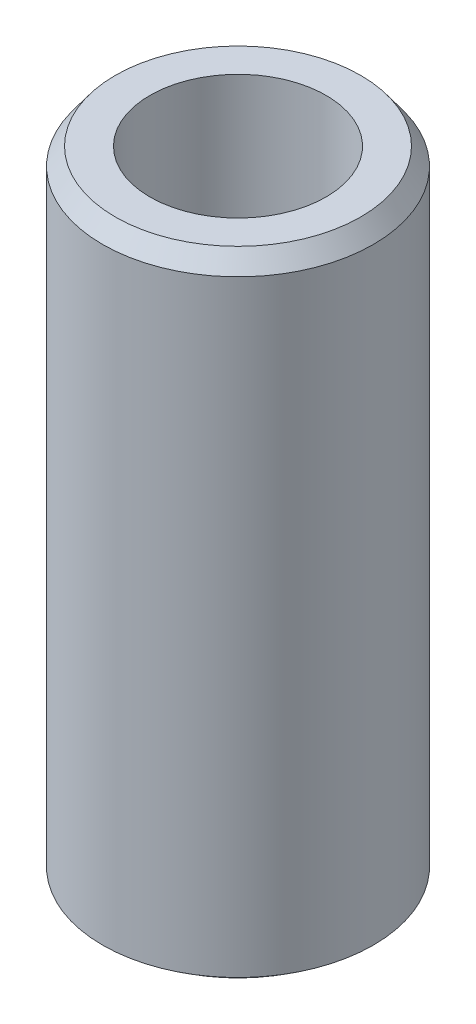
ISO-10303-21;
HEADER;
FILE_DESCRIPTION(('STEP AP214'),'2;1');
FILE_NAME('part.step','',(''),(''),'','','');
FILE_SCHEMA(('AUTOMOTIVE_DESIGN { 1 0 10303 214 1 1 1 1 }'));
ENDSEC;
DATA;
#1=APPLICATION_CONTEXT('core data for automotive mechanical design processes');
#2=APPLICATION_PROTOCOL_DEFINITION('international standard','automotive_design',2000,#1);
#3=PRODUCT_CONTEXT('',#1,'mechanical');
#4=PRODUCT('Part','Part','',(#3));
#5=PRODUCT_RELATED_PRODUCT_CATEGORY('part','',(#4));
#6=PRODUCT_DEFINITION_FORMATION('','',#4);
#7=PRODUCT_DEFINITION_CONTEXT('part definition',#1,'design');
#8=PRODUCT_DEFINITION('design','',#6,#7);
#9=PRODUCT_DEFINITION_SHAPE('','',#8);
#10=(LENGTH_UNIT() NAMED_UNIT(*) SI_UNIT(.MILLI.,.METRE.));
#11=(NAMED_UNIT(*) PLANE_ANGLE_UNIT() SI_UNIT($,.RADIAN.));
#12=(NAMED_UNIT(*) SI_UNIT($,.STERADIAN.) SOLID_ANGLE_UNIT());
#13=UNCERTAINTY_MEASURE_WITH_UNIT(LENGTH_MEASURE(1.E-05),#10,'distance_accuracy_value','');
#14=(GEOMETRIC_REPRESENTATION_CONTEXT(3) GLOBAL_UNCERTAINTY_ASSIGNED_CONTEXT((#13)) GLOBAL_UNIT_ASSIGNED_CONTEXT((#10,
#11,#12)) REPRESENTATION_CONTEXT('',''));
#15=CARTESIAN_POINT('',(0.,0.,0.));
#16=DIRECTION('',(0.,0.,1.));
#17=DIRECTION('',(1.,0.,0.));
#18=AXIS2_PLACEMENT_3D('',#15,#16,#17);
#19=CARTESIAN_POINT('',(0.,82.3235034673691,0.));
#20=DIRECTION('',(0.,-1.,0.));
#21=DIRECTION('',(0.,0.,-1.));
#22=AXIS2_PLACEMENT_3D('',#19,#20,#21);
#23=CYLINDRICAL_SURFACE('',#22,17.5);
#24=CARTESIAN_POINT('',(0.,80.0735030648087,0.));
#25=DIRECTION('',(0.,1.,0.));
#26=DIRECTION('',(0.,0.,1.));
#27=AXIS2_PLACEMENT_3D('',#24,#25,#26);
#28=CIRCLE('',#27,17.5);
#29=CARTESIAN_POINT('',(0.,80.0735030648087,17.5));
#30=VERTEX_POINT('',#29);
#31=EDGE_CURVE('E50',#30,#30,#28,.F.);
#32=ORIENTED_EDGE('',*,*,#31,.T.);
#33=EDGE_LOOP('',(#32));
#34=FACE_BOUND('',#33,.T.);
#35=CARTESIAN_POINT('',(0.,1.64277328169302,0.));
#36=DIRECTION('',(0.,1.,0.));
#37=DIRECTION('',(0.,0.,1.));
#38=AXIS2_PLACEMENT_3D('',#35,#36,#37);
#39=CIRCLE('',#38,17.5);
#40=CARTESIAN_POINT('',(0.,1.64277328169302,17.5));
#41=VERTEX_POINT('',#40);
#42=EDGE_CURVE('E51',#41,#41,#39,.T.);
#43=ORIENTED_EDGE('',*,*,#42,.T.);
#44=EDGE_LOOP('',(#43));
#45=FACE_BOUND('',#44,.T.);
#46=ADVANCED_FACE('F39',(#34,#45),#23,.T.);
#47=CARTESIAN_POINT('',(0.,82.3235034673691,0.));
#48=DIRECTION('',(0.,1.,0.));
#49=DIRECTION('',(0.,0.,1.));
#50=AXIS2_PLACEMENT_3D('',#47,#48,#49);
#51=PLANE('',#50);
#52=CARTESIAN_POINT('',(0.,82.3235034673691,0.));
#53=DIRECTION('',(0.,1.,0.));
#54=DIRECTION('',(0.,0.,1.));
#55=AXIS2_PLACEMENT_3D('',#52,#53,#54);
#56=CIRCLE('',#55,15.857226718307);
#57=CARTESIAN_POINT('',(0.,82.3235034673691,15.857226718307));
#58=VERTEX_POINT('',#57);
#59=EDGE_CURVE('E54',#58,#58,#56,.T.);
#60=ORIENTED_EDGE('',*,*,#59,.T.);
#61=EDGE_LOOP('',(#60));
#62=FACE_BOUND('',#61,.T.);
#63=CARTESIAN_POINT('',(0.,82.3235034673691,0.));
#64=DIRECTION('',(0.,1.,0.));
#65=DIRECTION('',(0.,0.,1.));
#66=AXIS2_PLACEMENT_3D('',#63,#64,#65);
#67=CIRCLE('',#66,11.3833069216724);
#68=CARTESIAN_POINT('',(0.,82.3235034673691,11.3833069216724));
#69=VERTEX_POINT('',#68);
#70=EDGE_CURVE('E58',#69,#69,#67,.T.);
#71=ORIENTED_EDGE('',*,*,#70,.F.);
#72=EDGE_LOOP('',(#71));
#73=FACE_BOUND('',#72,.T.);
#74=ADVANCED_FACE('F69',(#62,#73),#51,.T.);
#75=CARTESIAN_POINT('',(0.,0.,0.));
#76=DIRECTION('',(0.,1.,0.));
#77=DIRECTION('',(0.,0.,1.));
#78=AXIS2_PLACEMENT_3D('',#75,#76,#77);
#79=PLANE('',#78);
#80=CARTESIAN_POINT('',(0.,0.,0.));
#81=DIRECTION('',(0.,1.,0.));
#82=DIRECTION('',(0.,0.,1.));
#83=AXIS2_PLACEMENT_3D('',#80,#81,#82);
#84=CIRCLE('',#83,15.2499995974396);
#85=CARTESIAN_POINT('',(0.,0.,15.2499995974396));
#86=VERTEX_POINT('',#85);
#87=EDGE_CURVE('E10',#86,#86,#84,.F.);
#88=ORIENTED_EDGE('',*,*,#87,.T.);
#89=EDGE_LOOP('',(#88));
#90=FACE_BOUND('',#89,.T.);
#91=CARTESIAN_POINT('',(0.,0.,0.));
#92=DIRECTION('',(0.,1.,0.));
#93=DIRECTION('',(0.,0.,1.));
#94=AXIS2_PLACEMENT_3D('',#91,#92,#93);
#95=CIRCLE('',#94,11.3833069216724);
#96=CARTESIAN_POINT('',(0.,0.,11.3833069216724));
#97=VERTEX_POINT('',#96);
#98=EDGE_CURVE('E63',#97,#97,#95,.T.);
#99=ORIENTED_EDGE('',*,*,#98,.T.);
#100=EDGE_LOOP('',(#99));
#101=FACE_BOUND('',#100,.T.);
#102=ADVANCED_FACE('F75',(#90,#101),#79,.F.);
#103=CARTESIAN_POINT('',(0.,82.3235034673691,0.));
#104=DIRECTION('',(0.,-1.,0.));
#105=DIRECTION('',(0.,0.,-1.));
#106=AXIS2_PLACEMENT_3D('',#103,#104,#105);
#107=CYLINDRICAL_SURFACE('',#106,11.3833069216724);
#108=ORIENTED_EDGE('',*,*,#70,.T.);
#109=EDGE_LOOP('',(#108));
#110=FACE_BOUND('',#109,.T.);
#111=ORIENTED_EDGE('',*,*,#98,.F.);
#112=EDGE_LOOP('',(#111));
#113=FACE_BOUND('',#112,.T.);
#114=ADVANCED_FACE('F70',(#110,#113),#107,.F.);
#115=CARTESIAN_POINT('',(0.,82.3235034673691,0.));
#116=DIRECTION('',(0.,-1.,0.));
#117=DIRECTION('',(0.,0.,-1.));
#118=AXIS2_PLACEMENT_3D('',#115,#116,#117);
#119=CONICAL_SURFACE('',#118,15.857226718307,0.630656901901474);
#120=ORIENTED_EDGE('',*,*,#31,.F.);
#121=EDGE_LOOP('',(#120));
#122=FACE_BOUND('',#121,.T.);
#123=ORIENTED_EDGE('',*,*,#59,.F.);
#124=EDGE_LOOP('',(#123));
#125=FACE_BOUND('',#124,.T.);
#126=ADVANCED_FACE('F81',(#122,#125),#119,.T.);
#127=CARTESIAN_POINT('',(0.,1.64277328169302,0.));
#128=DIRECTION('',(0.,1.,0.));
#129=DIRECTION('',(0.,0.,1.));
#130=AXIS2_PLACEMENT_3D('',#127,#128,#129);
#131=CONICAL_SURFACE('',#130,17.5,0.940139424893425);
#132=ORIENTED_EDGE('',*,*,#87,.F.);
#133=EDGE_LOOP('',(#132));
#134=FACE_BOUND('',#133,.T.);
#135=ORIENTED_EDGE('',*,*,#42,.F.);
#136=EDGE_LOOP('',(#135));
#137=FACE_BOUND('',#136,.T.);
#138=ADVANCED_FACE('F45',(#134,#137),#131,.T.);
#139=CLOSED_SHELL('',(#46,#74,#102,#114,#126,#138));
#140=MANIFOLD_SOLID_BREP('B2',#139);
#141=ADVANCED_BREP_SHAPE_REPRESENTATION('',(#18,#140),#14);
#142=SHAPE_DEFINITION_REPRESENTATION(#9,#141);
ENDSEC;
END-ISO-10303-21;
